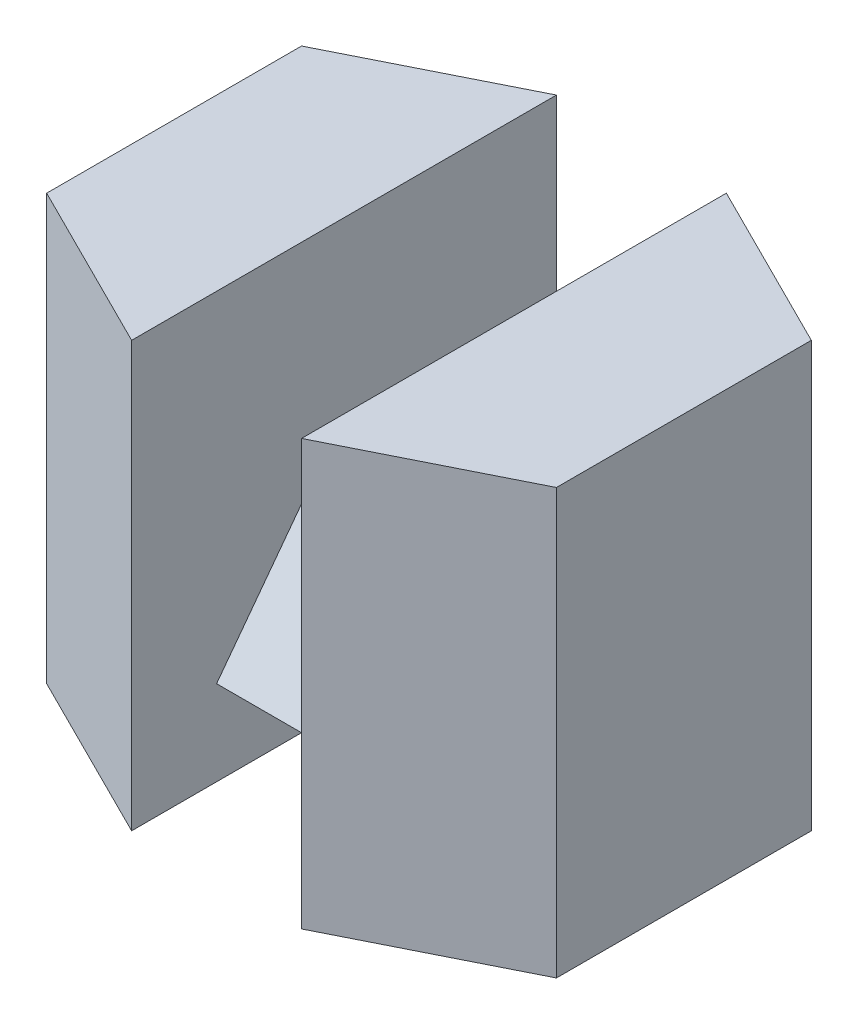
ISO-10303-21;
HEADER;
FILE_DESCRIPTION(('STEP AP214'),'2;1');
FILE_NAME('part.step','',(''),(''),'','','');
FILE_SCHEMA(('AUTOMOTIVE_DESIGN { 1 0 10303 214 1 1 1 1 }'));
ENDSEC;
DATA;
#1=APPLICATION_CONTEXT('core data for automotive mechanical design processes');
#2=APPLICATION_PROTOCOL_DEFINITION('international standard','automotive_design',2000,#1);
#3=PRODUCT_CONTEXT('',#1,'mechanical');
#4=PRODUCT('Part','Part','',(#3));
#5=PRODUCT_RELATED_PRODUCT_CATEGORY('part','',(#4));
#6=PRODUCT_DEFINITION_FORMATION('','',#4);
#7=PRODUCT_DEFINITION_CONTEXT('part definition',#1,'design');
#8=PRODUCT_DEFINITION('design','',#6,#7);
#9=PRODUCT_DEFINITION_SHAPE('','',#8);
#10=(LENGTH_UNIT() NAMED_UNIT(*) SI_UNIT(.MILLI.,.METRE.));
#11=(NAMED_UNIT(*) PLANE_ANGLE_UNIT() SI_UNIT($,.RADIAN.));
#12=(NAMED_UNIT(*) SI_UNIT($,.STERADIAN.) SOLID_ANGLE_UNIT());
#13=UNCERTAINTY_MEASURE_WITH_UNIT(LENGTH_MEASURE(1.E-05),#10,'distance_accuracy_value','');
#14=(GEOMETRIC_REPRESENTATION_CONTEXT(3) GLOBAL_UNCERTAINTY_ASSIGNED_CONTEXT((#13)) GLOBAL_UNIT_ASSIGNED_CONTEXT((#10,
#11,#12)) REPRESENTATION_CONTEXT('',''));
#15=CARTESIAN_POINT('',(0.,0.,0.));
#16=DIRECTION('',(0.,0.,1.));
#17=DIRECTION('',(1.,0.,0.));
#18=AXIS2_PLACEMENT_3D('',#15,#16,#17);
#19=CARTESIAN_POINT('',(0.,0.,25.));
#20=DIRECTION('',(1.,0.,0.));
#21=DIRECTION('',(0.,0.,-1.));
#22=AXIS2_PLACEMENT_3D('',#19,#20,#21);
#23=PLANE('',#22);
#24=DIRECTION('',(0.,0.,1.));
#25=VECTOR('',#24,1.);
#26=CARTESIAN_POINT('',(0.,5.,5.));
#27=LINE('',#26,#25);
#28=CARTESIAN_POINT('',(0.,5.,5.));
#29=VERTEX_POINT('',#28);
#30=CARTESIAN_POINT('',(0.,5.,20.));
#31=VERTEX_POINT('',#30);
#32=EDGE_CURVE('E175',#29,#31,#27,.T.);
#33=ORIENTED_EDGE('',*,*,#32,.F.);
#34=DIRECTION('',(0.,0.8,0.6));
#35=VECTOR('',#34,1.);
#36=CARTESIAN_POINT('',(0.,-0.6,0.799999999999999));
#37=LINE('',#36,#35);
#38=CARTESIAN_POINT('',(0.,15.,12.5));
#39=VERTEX_POINT('',#38);
#40=EDGE_CURVE('E160',#29,#39,#37,.T.);
#41=ORIENTED_EDGE('',*,*,#40,.T.);
#42=DIRECTION('',(0.,-0.8,0.6));
#43=VECTOR('',#42,1.);
#44=CARTESIAN_POINT('',(0.,11.4,15.2));
#45=LINE('',#44,#43);
#46=EDGE_CURVE('E167',#39,#31,#45,.T.);
#47=ORIENTED_EDGE('',*,*,#46,.T.);
#48=EDGE_LOOP('',(#33,#41,#47));
#49=FACE_BOUND('',#48,.T.);
#50=DIRECTION('',(0.,-1.,0.));
#51=VECTOR('',#50,1.);
#52=CARTESIAN_POINT('',(0.,0.,0.));
#53=LINE('',#52,#51);
#54=CARTESIAN_POINT('',(0.,25.,0.));
#55=VERTEX_POINT('',#54);
#56=CARTESIAN_POINT('',(0.,0.,0.));
#57=VERTEX_POINT('',#56);
#58=EDGE_CURVE('E196',#55,#57,#53,.T.);
#59=ORIENTED_EDGE('',*,*,#58,.T.);
#60=DIRECTION('',(0.,0.,-1.));
#61=VECTOR('',#60,1.);
#62=CARTESIAN_POINT('',(0.,0.,25.));
#63=LINE('',#62,#61);
#64=CARTESIAN_POINT('',(0.,0.,25.));
#65=VERTEX_POINT('',#64);
#66=EDGE_CURVE('E12',#65,#57,#63,.T.);
#67=ORIENTED_EDGE('',*,*,#66,.F.);
#68=DIRECTION('',(0.,-1.,0.));
#69=VECTOR('',#68,1.);
#70=CARTESIAN_POINT('',(0.,0.,25.));
#71=LINE('',#70,#69);
#72=CARTESIAN_POINT('',(0.,25.,25.));
#73=VERTEX_POINT('',#72);
#74=EDGE_CURVE('E202',#73,#65,#71,.T.);
#75=ORIENTED_EDGE('',*,*,#74,.F.);
#76=DIRECTION('',(0.,0.,-1.));
#77=VECTOR('',#76,1.);
#78=CARTESIAN_POINT('',(0.,25.,25.));
#79=LINE('',#78,#77);
#80=EDGE_CURVE('E204',#73,#55,#79,.T.);
#81=ORIENTED_EDGE('',*,*,#80,.T.);
#82=EDGE_LOOP('',(#59,#67,#75,#81));
#83=FACE_BOUND('',#82,.T.);
#84=ADVANCED_FACE('F51',(#49,#83),#23,.F.);
#85=CARTESIAN_POINT('',(0.,0.,25.));
#86=DIRECTION('',(0.,1.,0.));
#87=DIRECTION('',(0.,0.,1.));
#88=AXIS2_PLACEMENT_3D('',#85,#86,#87);
#89=PLANE('',#88);
#90=ORIENTED_EDGE('',*,*,#66,.T.);
#91=DIRECTION('',(0.894427190999916,0.,0.447213595499958));
#92=VECTOR('',#91,1.);
#93=CARTESIAN_POINT('',(10.,0.,5.));
#94=LINE('',#93,#92);
#95=CARTESIAN_POINT('',(10.,0.,5.));
#96=VERTEX_POINT('',#95);
#97=EDGE_CURVE('E187',#57,#96,#94,.T.);
#98=ORIENTED_EDGE('',*,*,#97,.T.);
#99=DIRECTION('',(0.,0.,-1.));
#100=VECTOR('',#99,1.);
#101=CARTESIAN_POINT('',(10.,0.,25.));
#102=LINE('',#101,#100);
#103=CARTESIAN_POINT('',(10.,0.,20.));
#104=VERTEX_POINT('',#103);
#105=EDGE_CURVE('E58',#104,#96,#102,.T.);
#106=ORIENTED_EDGE('',*,*,#105,.F.);
#107=DIRECTION('',(-0.894427190999916,0.,0.447213595499958));
#108=VECTOR('',#107,1.);
#109=CARTESIAN_POINT('',(0.,0.,25.));
#110=LINE('',#109,#108);
#111=EDGE_CURVE('E197',#104,#65,#110,.T.);
#112=ORIENTED_EDGE('',*,*,#111,.T.);
#113=EDGE_LOOP('',(#90,#98,#106,#112));
#114=FACE_BOUND('',#113,.T.);
#115=ADVANCED_FACE('F218',(#114),#89,.F.);
#116=CARTESIAN_POINT('',(10.,0.,25.));
#117=DIRECTION('',(-1.,0.,0.));
#118=DIRECTION('',(0.,0.,1.));
#119=AXIS2_PLACEMENT_3D('',#116,#117,#118);
#120=PLANE('',#119);
#121=ORIENTED_EDGE('',*,*,#105,.T.);
#122=DIRECTION('',(0.,1.,0.));
#123=VECTOR('',#122,1.);
#124=CARTESIAN_POINT('',(10.,0.,5.));
#125=LINE('',#124,#123);
#126=CARTESIAN_POINT('',(10.,25.,5.));
#127=VERTEX_POINT('',#126);
#128=EDGE_CURVE('E190',#96,#127,#125,.T.);
#129=ORIENTED_EDGE('',*,*,#128,.T.);
#130=DIRECTION('',(0.,0.,-1.));
#131=VECTOR('',#130,1.);
#132=CARTESIAN_POINT('',(10.,25.,25.));
#133=LINE('',#132,#131);
#134=CARTESIAN_POINT('',(10.,25.,20.));
#135=VERTEX_POINT('',#134);
#136=EDGE_CURVE('E209',#135,#127,#133,.T.);
#137=ORIENTED_EDGE('',*,*,#136,.F.);
#138=DIRECTION('',(0.,1.,0.));
#139=VECTOR('',#138,1.);
#140=CARTESIAN_POINT('',(10.,0.,20.));
#141=LINE('',#140,#139);
#142=EDGE_CURVE('E193',#104,#135,#141,.T.);
#143=ORIENTED_EDGE('',*,*,#142,.F.);
#144=EDGE_LOOP('',(#121,#129,#137,#143));
#145=FACE_BOUND('',#144,.T.);
#146=ADVANCED_FACE('F215',(#145),#120,.F.);
#147=CARTESIAN_POINT('',(0.,25.,25.));
#148=DIRECTION('',(0.,-1.,0.));
#149=DIRECTION('',(0.,0.,-1.));
#150=AXIS2_PLACEMENT_3D('',#147,#148,#149);
#151=PLANE('',#150);
#152=ORIENTED_EDGE('',*,*,#136,.T.);
#153=DIRECTION('',(0.894427190999916,0.,0.447213595499958));
#154=VECTOR('',#153,1.);
#155=CARTESIAN_POINT('',(10.,25.,5.));
#156=LINE('',#155,#154);
#157=EDGE_CURVE('E191',#55,#127,#156,.T.);
#158=ORIENTED_EDGE('',*,*,#157,.F.);
#159=ORIENTED_EDGE('',*,*,#80,.F.);
#160=DIRECTION('',(-0.894427190999916,0.,0.447213595499958));
#161=VECTOR('',#160,1.);
#162=CARTESIAN_POINT('',(0.,25.,25.));
#163=LINE('',#162,#161);
#164=EDGE_CURVE('E186',#135,#73,#163,.T.);
#165=ORIENTED_EDGE('',*,*,#164,.F.);
#166=EDGE_LOOP('',(#152,#158,#159,#165));
#167=FACE_BOUND('',#166,.T.);
#168=ADVANCED_FACE('F225',(#167),#151,.F.);
#169=CARTESIAN_POINT('',(10.,0.,5.));
#170=DIRECTION('',(-0.447213595499958,0.,0.894427190999916));
#171=DIRECTION('',(0.894427190999916,0.,0.447213595499958));
#172=AXIS2_PLACEMENT_3D('',#169,#170,#171);
#173=PLANE('',#172);
#174=ORIENTED_EDGE('',*,*,#157,.T.);
#175=ORIENTED_EDGE('',*,*,#128,.F.);
#176=ORIENTED_EDGE('',*,*,#97,.F.);
#177=ORIENTED_EDGE('',*,*,#58,.F.);
#178=EDGE_LOOP('',(#174,#175,#176,#177));
#179=FACE_BOUND('',#178,.T.);
#180=ADVANCED_FACE('F221',(#179),#173,.F.);
#181=CARTESIAN_POINT('',(0.,0.,25.));
#182=DIRECTION('',(-0.447213595499958,0.,-0.894427190999916));
#183=DIRECTION('',(-0.894427190999916,0.,0.447213595499958));
#184=AXIS2_PLACEMENT_3D('',#181,#182,#183);
#185=PLANE('',#184);
#186=ORIENTED_EDGE('',*,*,#164,.T.);
#187=ORIENTED_EDGE('',*,*,#74,.T.);
#188=ORIENTED_EDGE('',*,*,#111,.F.);
#189=ORIENTED_EDGE('',*,*,#142,.T.);
#190=EDGE_LOOP('',(#186,#187,#188,#189));
#191=FACE_BOUND('',#190,.T.);
#192=ADVANCED_FACE('F230',(#191),#185,.F.);
#193=CARTESIAN_POINT('',(-10.,5.,5.));
#194=DIRECTION('',(0.,1.,0.));
#195=DIRECTION('',(0.,0.,1.));
#196=AXIS2_PLACEMENT_3D('',#193,#194,#195);
#197=PLANE('',#196);
#198=ORIENTED_EDGE('',*,*,#32,.T.);
#199=DIRECTION('',(1.,0.,0.));
#200=VECTOR('',#199,1.);
#201=CARTESIAN_POINT('',(-10.,5.,20.));
#202=LINE('',#201,#200);
#203=CARTESIAN_POINT('',(-10.,5.,20.));
#204=VERTEX_POINT('',#203);
#205=EDGE_CURVE('E179',#204,#31,#202,.T.);
#206=ORIENTED_EDGE('',*,*,#205,.F.);
#207=DIRECTION('',(0.,0.,1.));
#208=VECTOR('',#207,1.);
#209=CARTESIAN_POINT('',(-10.,5.,5.));
#210=LINE('',#209,#208);
#211=CARTESIAN_POINT('',(-10.,5.,5.));
#212=VERTEX_POINT('',#211);
#213=EDGE_CURVE('E176',#212,#204,#210,.T.);
#214=ORIENTED_EDGE('',*,*,#213,.F.);
#215=DIRECTION('',(1.,0.,0.));
#216=VECTOR('',#215,1.);
#217=CARTESIAN_POINT('',(-10.,5.,5.));
#218=LINE('',#217,#216);
#219=EDGE_CURVE('E183',#212,#29,#218,.T.);
#220=ORIENTED_EDGE('',*,*,#219,.T.);
#221=EDGE_LOOP('',(#198,#206,#214,#220));
#222=FACE_BOUND('',#221,.T.);
#223=ADVANCED_FACE('F232',(#222),#197,.F.);
#224=CARTESIAN_POINT('',(0.,11.4,15.2));
#225=DIRECTION('',(0.,-0.6,-0.8));
#226=DIRECTION('',(0.,0.8,-0.6));
#227=AXIS2_PLACEMENT_3D('',#224,#225,#226);
#228=PLANE('',#227);
#229=DIRECTION('',(0.,-0.8,0.6));
#230=VECTOR('',#229,1.);
#231=CARTESIAN_POINT('',(-10.,11.4,15.2));
#232=LINE('',#231,#230);
#233=CARTESIAN_POINT('',(-10.,15.,12.5));
#234=VERTEX_POINT('',#233);
#235=EDGE_CURVE('E163',#234,#204,#232,.T.);
#236=ORIENTED_EDGE('',*,*,#235,.T.);
#237=ORIENTED_EDGE('',*,*,#205,.T.);
#238=ORIENTED_EDGE('',*,*,#46,.F.);
#239=DIRECTION('',(-1.,0.,0.));
#240=VECTOR('',#239,1.);
#241=CARTESIAN_POINT('',(0.,15.,12.5));
#242=LINE('',#241,#240);
#243=EDGE_CURVE('E170',#39,#234,#242,.T.);
#244=ORIENTED_EDGE('',*,*,#243,.T.);
#245=EDGE_LOOP('',(#236,#237,#238,#244));
#246=FACE_BOUND('',#245,.T.);
#247=ADVANCED_FACE('F238',(#246),#228,.F.);
#248=CARTESIAN_POINT('',(0.,-0.6,0.799999999999999));
#249=DIRECTION('',(0.,-0.6,0.8));
#250=DIRECTION('',(0.,-0.8,-0.6));
#251=AXIS2_PLACEMENT_3D('',#248,#249,#250);
#252=PLANE('',#251);
#253=DIRECTION('',(0.,0.8,0.6));
#254=VECTOR('',#253,1.);
#255=CARTESIAN_POINT('',(-10.,-0.6,0.799999999999999));
#256=LINE('',#255,#254);
#257=EDGE_CURVE('E164',#212,#234,#256,.T.);
#258=ORIENTED_EDGE('',*,*,#257,.T.);
#259=ORIENTED_EDGE('',*,*,#243,.F.);
#260=ORIENTED_EDGE('',*,*,#40,.F.);
#261=ORIENTED_EDGE('',*,*,#219,.F.);
#262=EDGE_LOOP('',(#258,#259,#260,#261));
#263=FACE_BOUND('',#262,.T.);
#264=ADVANCED_FACE('F253',(#263),#252,.F.);
#265=CARTESIAN_POINT('',(-10.,0.,0.));
#266=DIRECTION('',(1.,0.,0.));
#267=DIRECTION('',(0.,0.,-1.));
#268=AXIS2_PLACEMENT_3D('',#265,#266,#267);
#269=PLANE('',#268);
#270=DIRECTION('',(0.,-1.,0.));
#271=VECTOR('',#270,1.);
#272=CARTESIAN_POINT('',(-10.,0.,0.));
#273=LINE('',#272,#271);
#274=CARTESIAN_POINT('',(-10.,25.,0.));
#275=VERTEX_POINT('',#274);
#276=CARTESIAN_POINT('',(-10.,0.,0.));
#277=VERTEX_POINT('',#276);
#278=EDGE_CURVE('E131',#275,#277,#273,.T.);
#279=ORIENTED_EDGE('',*,*,#278,.F.);
#280=DIRECTION('',(0.,0.,-1.));
#281=VECTOR('',#280,1.);
#282=CARTESIAN_POINT('',(-10.,25.,0.));
#283=LINE('',#282,#281);
#284=CARTESIAN_POINT('',(-10.,25.,25.));
#285=VERTEX_POINT('',#284);
#286=EDGE_CURVE('E155',#285,#275,#283,.T.);
#287=ORIENTED_EDGE('',*,*,#286,.F.);
#288=DIRECTION('',(0.,1.,0.));
#289=VECTOR('',#288,1.);
#290=CARTESIAN_POINT('',(-10.,0.,25.));
#291=LINE('',#290,#289);
#292=CARTESIAN_POINT('',(-10.,0.,25.));
#293=VERTEX_POINT('',#292);
#294=EDGE_CURVE('E153',#293,#285,#291,.T.);
#295=ORIENTED_EDGE('',*,*,#294,.F.);
#296=DIRECTION('',(0.,0.,1.));
#297=VECTOR('',#296,1.);
#298=CARTESIAN_POINT('',(-10.,0.,0.));
#299=LINE('',#298,#297);
#300=EDGE_CURVE('E139',#277,#293,#299,.T.);
#301=ORIENTED_EDGE('',*,*,#300,.F.);
#302=EDGE_LOOP('',(#279,#287,#295,#301));
#303=FACE_BOUND('',#302,.T.);
#304=ORIENTED_EDGE('',*,*,#235,.F.);
#305=ORIENTED_EDGE('',*,*,#257,.F.);
#306=ORIENTED_EDGE('',*,*,#213,.T.);
#307=EDGE_LOOP('',(#304,#305,#306));
#308=FACE_BOUND('',#307,.T.);
#309=ADVANCED_FACE('F151',(#303,#308),#269,.T.);
#310=CARTESIAN_POINT('',(-20.,0.,0.));
#311=DIRECTION('',(0.,1.,0.));
#312=DIRECTION('',(0.,0.,1.));
#313=AXIS2_PLACEMENT_3D('',#310,#311,#312);
#314=PLANE('',#313);
#315=DIRECTION('',(0.,0.,1.));
#316=VECTOR('',#315,1.);
#317=CARTESIAN_POINT('',(-20.,0.,0.));
#318=LINE('',#317,#316);
#319=CARTESIAN_POINT('',(-20.,0.,5.));
#320=VERTEX_POINT('',#319);
#321=CARTESIAN_POINT('',(-20.,0.,20.));
#322=VERTEX_POINT('',#321);
#323=EDGE_CURVE('E149',#320,#322,#318,.T.);
#324=ORIENTED_EDGE('',*,*,#323,.F.);
#325=DIRECTION('',(0.894427190999916,0.,-0.447213595499958));
#326=VECTOR('',#325,1.);
#327=CARTESIAN_POINT('',(-20.,0.,5.));
#328=LINE('',#327,#326);
#329=EDGE_CURVE('E73',#320,#277,#328,.T.);
#330=ORIENTED_EDGE('',*,*,#329,.T.);
#331=ORIENTED_EDGE('',*,*,#300,.T.);
#332=DIRECTION('',(-0.894427190999916,0.,-0.447213595499958));
#333=VECTOR('',#332,1.);
#334=CARTESIAN_POINT('',(-20.,0.,20.));
#335=LINE('',#334,#333);
#336=EDGE_CURVE('E331',#293,#322,#335,.T.);
#337=ORIENTED_EDGE('',*,*,#336,.T.);
#338=EDGE_LOOP('',(#324,#330,#331,#337));
#339=FACE_BOUND('',#338,.T.);
#340=ADVANCED_FACE('F145',(#339),#314,.F.);
#341=CARTESIAN_POINT('',(-20.,25.,0.));
#342=DIRECTION('',(0.,-1.,0.));
#343=DIRECTION('',(0.,0.,-1.));
#344=AXIS2_PLACEMENT_3D('',#341,#342,#343);
#345=PLANE('',#344);
#346=ORIENTED_EDGE('',*,*,#286,.T.);
#347=DIRECTION('',(0.894427190999916,0.,-0.447213595499958));
#348=VECTOR('',#347,1.);
#349=CARTESIAN_POINT('',(-20.,25.,5.));
#350=LINE('',#349,#348);
#351=CARTESIAN_POINT('',(-20.,25.,5.));
#352=VERTEX_POINT('',#351);
#353=EDGE_CURVE('E134',#352,#275,#350,.T.);
#354=ORIENTED_EDGE('',*,*,#353,.F.);
#355=DIRECTION('',(0.,0.,-1.));
#356=VECTOR('',#355,1.);
#357=CARTESIAN_POINT('',(-20.,25.,0.));
#358=LINE('',#357,#356);
#359=CARTESIAN_POINT('',(-20.,25.,20.));
#360=VERTEX_POINT('',#359);
#361=EDGE_CURVE('E166',#360,#352,#358,.T.);
#362=ORIENTED_EDGE('',*,*,#361,.F.);
#363=DIRECTION('',(-0.894427190999916,0.,-0.447213595499958));
#364=VECTOR('',#363,1.);
#365=CARTESIAN_POINT('',(-20.,25.,20.));
#366=LINE('',#365,#364);
#367=EDGE_CURVE('E65',#285,#360,#366,.T.);
#368=ORIENTED_EDGE('',*,*,#367,.F.);
#369=EDGE_LOOP('',(#346,#354,#362,#368));
#370=FACE_BOUND('',#369,.T.);
#371=ADVANCED_FACE('F262',(#370),#345,.F.);
#372=CARTESIAN_POINT('',(-20.,0.,0.));
#373=DIRECTION('',(1.,0.,0.));
#374=DIRECTION('',(0.,0.,-1.));
#375=AXIS2_PLACEMENT_3D('',#372,#373,#374);
#376=PLANE('',#375);
#377=ORIENTED_EDGE('',*,*,#361,.T.);
#378=DIRECTION('',(0.,1.,0.));
#379=VECTOR('',#378,1.);
#380=CARTESIAN_POINT('',(-20.,0.,5.));
#381=LINE('',#380,#379);
#382=EDGE_CURVE('E140',#320,#352,#381,.T.);
#383=ORIENTED_EDGE('',*,*,#382,.F.);
#384=ORIENTED_EDGE('',*,*,#323,.T.);
#385=DIRECTION('',(0.,1.,0.));
#386=VECTOR('',#385,1.);
#387=CARTESIAN_POINT('',(-20.,0.,20.));
#388=LINE('',#387,#386);
#389=EDGE_CURVE('E327',#322,#360,#388,.T.);
#390=ORIENTED_EDGE('',*,*,#389,.T.);
#391=EDGE_LOOP('',(#377,#383,#384,#390));
#392=FACE_BOUND('',#391,.T.);
#393=ADVANCED_FACE('F267',(#392),#376,.F.);
#394=CARTESIAN_POINT('',(-20.,0.,20.));
#395=DIRECTION('',(0.447213595499958,0.,-0.894427190999916));
#396=DIRECTION('',(-0.894427190999916,0.,-0.447213595499958));
#397=AXIS2_PLACEMENT_3D('',#394,#395,#396);
#398=PLANE('',#397);
#399=ORIENTED_EDGE('',*,*,#367,.T.);
#400=ORIENTED_EDGE('',*,*,#389,.F.);
#401=ORIENTED_EDGE('',*,*,#336,.F.);
#402=ORIENTED_EDGE('',*,*,#294,.T.);
#403=EDGE_LOOP('',(#399,#400,#401,#402));
#404=FACE_BOUND('',#403,.T.);
#405=ADVANCED_FACE('F306',(#404),#398,.F.);
#406=CARTESIAN_POINT('',(-20.,0.,5.));
#407=DIRECTION('',(0.447213595499958,0.,0.894427190999916));
#408=DIRECTION('',(0.894427190999916,0.,-0.447213595499958));
#409=AXIS2_PLACEMENT_3D('',#406,#407,#408);
#410=PLANE('',#409);
#411=ORIENTED_EDGE('',*,*,#353,.T.);
#412=ORIENTED_EDGE('',*,*,#278,.T.);
#413=ORIENTED_EDGE('',*,*,#329,.F.);
#414=ORIENTED_EDGE('',*,*,#382,.T.);
#415=EDGE_LOOP('',(#411,#412,#413,#414));
#416=FACE_BOUND('',#415,.T.);
#417=ADVANCED_FACE('F132',(#416),#410,.F.);
#418=CLOSED_SHELL('',(#84,#115,#146,#168,#180,#192,#223,#247,#264,#309,#340,#371,#393,#405,#417));
#419=MANIFOLD_SOLID_BREP('B2',#418);
#420=ADVANCED_BREP_SHAPE_REPRESENTATION('',(#18,#419),#14);
#421=SHAPE_DEFINITION_REPRESENTATION(#9,#420);
ENDSEC;
END-ISO-10303-21;
